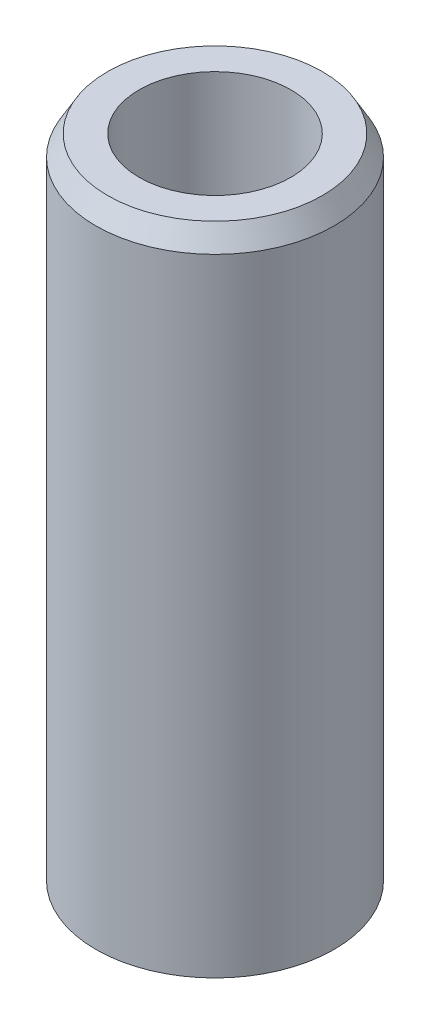
ISO-10303-21;
HEADER;
FILE_DESCRIPTION(('STEP AP214'),'2;1');
FILE_NAME('part.step','',(''),(''),'','','');
FILE_SCHEMA(('AUTOMOTIVE_DESIGN { 1 0 10303 214 1 1 1 1 }'));
ENDSEC;
DATA;
#1=APPLICATION_CONTEXT('core data for automotive mechanical design processes');
#2=APPLICATION_PROTOCOL_DEFINITION('international standard','automotive_design',2000,#1);
#3=PRODUCT_CONTEXT('',#1,'mechanical');
#4=PRODUCT('Part','Part','',(#3));
#5=PRODUCT_RELATED_PRODUCT_CATEGORY('part','',(#4));
#6=PRODUCT_DEFINITION_FORMATION('','',#4);
#7=PRODUCT_DEFINITION_CONTEXT('part definition',#1,'design');
#8=PRODUCT_DEFINITION('design','',#6,#7);
#9=PRODUCT_DEFINITION_SHAPE('','',#8);
#10=(LENGTH_UNIT() NAMED_UNIT(*) SI_UNIT(.MILLI.,.METRE.));
#11=(NAMED_UNIT(*) PLANE_ANGLE_UNIT() SI_UNIT($,.RADIAN.));
#12=(NAMED_UNIT(*) SI_UNIT($,.STERADIAN.) SOLID_ANGLE_UNIT());
#13=UNCERTAINTY_MEASURE_WITH_UNIT(LENGTH_MEASURE(1.E-05),#10,'distance_accuracy_value','');
#14=(GEOMETRIC_REPRESENTATION_CONTEXT(3) GLOBAL_UNCERTAINTY_ASSIGNED_CONTEXT((#13)) GLOBAL_UNIT_ASSIGNED_CONTEXT((#10,
#11,#12)) REPRESENTATION_CONTEXT('',''));
#15=CARTESIAN_POINT('',(0.,0.,0.));
#16=DIRECTION('',(0.,0.,1.));
#17=DIRECTION('',(1.,0.,0.));
#18=AXIS2_PLACEMENT_3D('',#15,#16,#17);
#19=CARTESIAN_POINT('',(0.,96.749567912477,0.));
#20=DIRECTION('',(0.,-1.,0.));
#21=DIRECTION('',(0.,0.,-1.));
#22=AXIS2_PLACEMENT_3D('',#19,#20,#21);
#23=CYLINDRICAL_SURFACE('',#22,17.5);
#24=CARTESIAN_POINT('',(0.,93.7549888850123,0.));
#25=DIRECTION('',(0.,1.,0.));
#26=DIRECTION('',(0.,0.,1.));
#27=AXIS2_PLACEMENT_3D('',#24,#25,#26);
#28=CIRCLE('',#27,17.5);
#29=CARTESIAN_POINT('',(0.,93.7549888850123,17.5));
#30=VERTEX_POINT('',#29);
#31=EDGE_CURVE('E50',#30,#30,#28,.F.);
#32=ORIENTED_EDGE('',*,*,#31,.T.);
#33=EDGE_LOOP('',(#32));
#34=FACE_BOUND('',#33,.T.);
#35=CARTESIAN_POINT('',(0.,1.7289210076163,0.));
#36=DIRECTION('',(0.,1.,0.));
#37=DIRECTION('',(0.,0.,1.));
#38=AXIS2_PLACEMENT_3D('',#35,#36,#37);
#39=CIRCLE('',#38,17.5);
#40=CARTESIAN_POINT('',(0.,1.7289210076163,17.5));
#41=VERTEX_POINT('',#40);
#42=EDGE_CURVE('E51',#41,#41,#39,.T.);
#43=ORIENTED_EDGE('',*,*,#42,.T.);
#44=EDGE_LOOP('',(#43));
#45=FACE_BOUND('',#44,.T.);
#46=ADVANCED_FACE('F39',(#34,#45),#23,.T.);
#47=CARTESIAN_POINT('',(0.,96.749567912477,0.));
#48=DIRECTION('',(0.,1.,0.));
#49=DIRECTION('',(0.,0.,1.));
#50=AXIS2_PLACEMENT_3D('',#47,#48,#49);
#51=PLANE('',#50);
#52=CARTESIAN_POINT('',(0.,96.749567912477,0.));
#53=DIRECTION('',(0.,1.,0.));
#54=DIRECTION('',(0.,0.,1.));
#55=AXIS2_PLACEMENT_3D('',#52,#53,#54);
#56=CIRCLE('',#55,15.7710789923837);
#57=CARTESIAN_POINT('',(0.,96.749567912477,15.7710789923837));
#58=VERTEX_POINT('',#57);
#59=EDGE_CURVE('E54',#58,#58,#56,.T.);
#60=ORIENTED_EDGE('',*,*,#59,.T.);
#61=EDGE_LOOP('',(#60));
#62=FACE_BOUND('',#61,.T.);
#63=CARTESIAN_POINT('',(0.,96.749567912477,0.));
#64=DIRECTION('',(0.,1.,0.));
#65=DIRECTION('',(0.,0.,1.));
#66=AXIS2_PLACEMENT_3D('',#63,#64,#65);
#67=CIRCLE('',#66,11.1462549305567);
#68=CARTESIAN_POINT('',(0.,96.749567912477,11.1462549305567));
#69=VERTEX_POINT('',#68);
#70=EDGE_CURVE('E58',#69,#69,#67,.T.);
#71=ORIENTED_EDGE('',*,*,#70,.F.);
#72=EDGE_LOOP('',(#71));
#73=FACE_BOUND('',#72,.T.);
#74=ADVANCED_FACE('F69',(#62,#73),#51,.T.);
#75=CARTESIAN_POINT('',(0.,0.,0.));
#76=DIRECTION('',(0.,1.,0.));
#77=DIRECTION('',(0.,0.,1.));
#78=AXIS2_PLACEMENT_3D('',#75,#76,#77);
#79=PLANE('',#78);
#80=CARTESIAN_POINT('',(0.,0.,0.));
#81=DIRECTION('',(0.,1.,0.));
#82=DIRECTION('',(0.,0.,1.));
#83=AXIS2_PLACEMENT_3D('',#80,#81,#82);
#84=CIRCLE('',#83,14.5054209725354);
#85=CARTESIAN_POINT('',(0.,0.,14.5054209725354));
#86=VERTEX_POINT('',#85);
#87=EDGE_CURVE('E10',#86,#86,#84,.F.);
#88=ORIENTED_EDGE('',*,*,#87,.T.);
#89=EDGE_LOOP('',(#88));
#90=FACE_BOUND('',#89,.T.);
#91=CARTESIAN_POINT('',(0.,0.,0.));
#92=DIRECTION('',(0.,1.,0.));
#93=DIRECTION('',(0.,0.,1.));
#94=AXIS2_PLACEMENT_3D('',#91,#92,#93);
#95=CIRCLE('',#94,11.1462549305567);
#96=CARTESIAN_POINT('',(0.,0.,11.1462549305567));
#97=VERTEX_POINT('',#96);
#98=EDGE_CURVE('E63',#97,#97,#95,.T.);
#99=ORIENTED_EDGE('',*,*,#98,.T.);
#100=EDGE_LOOP('',(#99));
#101=FACE_BOUND('',#100,.T.);
#102=ADVANCED_FACE('F75',(#90,#101),#79,.F.);
#103=CARTESIAN_POINT('',(0.,96.749567912477,0.));
#104=DIRECTION('',(0.,-1.,0.));
#105=DIRECTION('',(0.,0.,-1.));
#106=AXIS2_PLACEMENT_3D('',#103,#104,#105);
#107=CYLINDRICAL_SURFACE('',#106,11.1462549305567);
#108=ORIENTED_EDGE('',*,*,#70,.T.);
#109=EDGE_LOOP('',(#108));
#110=FACE_BOUND('',#109,.T.);
#111=ORIENTED_EDGE('',*,*,#98,.F.);
#112=EDGE_LOOP('',(#111));
#113=FACE_BOUND('',#112,.T.);
#114=ADVANCED_FACE('F70',(#110,#113),#107,.F.);
#115=CARTESIAN_POINT('',(0.,96.749567912477,0.));
#116=DIRECTION('',(0.,-1.,0.));
#117=DIRECTION('',(0.,0.,-1.));
#118=AXIS2_PLACEMENT_3D('',#115,#116,#117);
#119=CONICAL_SURFACE('',#118,15.7710789923837,0.523598775598296);
#120=ORIENTED_EDGE('',*,*,#31,.F.);
#121=EDGE_LOOP('',(#120));
#122=FACE_BOUND('',#121,.T.);
#123=ORIENTED_EDGE('',*,*,#59,.F.);
#124=EDGE_LOOP('',(#123));
#125=FACE_BOUND('',#124,.T.);
#126=ADVANCED_FACE('F81',(#122,#125),#119,.T.);
#127=CARTESIAN_POINT('',(0.,1.7289210076163,0.));
#128=DIRECTION('',(0.,1.,0.));
#129=DIRECTION('',(0.,0.,1.));
#130=AXIS2_PLACEMENT_3D('',#127,#128,#129);
#131=CONICAL_SURFACE('',#130,17.5,1.0471975511966);
#132=ORIENTED_EDGE('',*,*,#87,.F.);
#133=EDGE_LOOP('',(#132));
#134=FACE_BOUND('',#133,.T.);
#135=ORIENTED_EDGE('',*,*,#42,.F.);
#136=EDGE_LOOP('',(#135));
#137=FACE_BOUND('',#136,.T.);
#138=ADVANCED_FACE('F45',(#134,#137),#131,.T.);
#139=CLOSED_SHELL('',(#46,#74,#102,#114,#126,#138));
#140=MANIFOLD_SOLID_BREP('B2',#139);
#141=ADVANCED_BREP_SHAPE_REPRESENTATION('',(#18,#140),#14);
#142=SHAPE_DEFINITION_REPRESENTATION(#9,#141);
ENDSEC;
END-ISO-10303-21;
